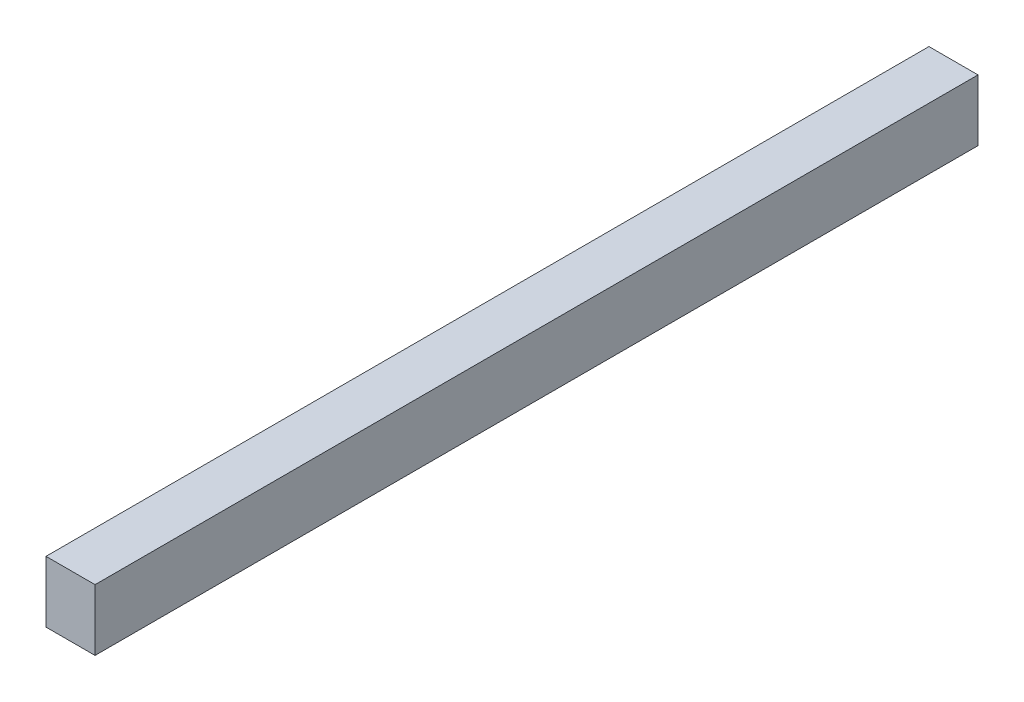
ISO-10303-21;
HEADER;
FILE_DESCRIPTION(('STEP AP214'),'2;1');
FILE_NAME('part.step','',(''),(''),'','','');
FILE_SCHEMA(('AUTOMOTIVE_DESIGN { 1 0 10303 214 1 1 1 1 }'));
ENDSEC;
DATA;
#1=APPLICATION_CONTEXT('core data for automotive mechanical design processes');
#2=APPLICATION_PROTOCOL_DEFINITION('international standard','automotive_design',2000,#1);
#3=PRODUCT_CONTEXT('',#1,'mechanical');
#4=PRODUCT('Part','Part','',(#3));
#5=PRODUCT_RELATED_PRODUCT_CATEGORY('part','',(#4));
#6=PRODUCT_DEFINITION_FORMATION('','',#4);
#7=PRODUCT_DEFINITION_CONTEXT('part definition',#1,'design');
#8=PRODUCT_DEFINITION('design','',#6,#7);
#9=PRODUCT_DEFINITION_SHAPE('','',#8);
#10=(LENGTH_UNIT() NAMED_UNIT(*) SI_UNIT(.MILLI.,.METRE.));
#11=(NAMED_UNIT(*) PLANE_ANGLE_UNIT() SI_UNIT($,.RADIAN.));
#12=(NAMED_UNIT(*) SI_UNIT($,.STERADIAN.) SOLID_ANGLE_UNIT());
#13=UNCERTAINTY_MEASURE_WITH_UNIT(LENGTH_MEASURE(1.E-05),#10,'distance_accuracy_value','');
#14=(GEOMETRIC_REPRESENTATION_CONTEXT(3) GLOBAL_UNCERTAINTY_ASSIGNED_CONTEXT((#13)) GLOBAL_UNIT_ASSIGNED_CONTEXT((#10,
#11,#12)) REPRESENTATION_CONTEXT('',''));
#15=CARTESIAN_POINT('',(0.,0.,0.));
#16=DIRECTION('',(0.,0.,1.));
#17=DIRECTION('',(1.,0.,0.));
#18=AXIS2_PLACEMENT_3D('',#15,#16,#17);
#19=CARTESIAN_POINT('',(12.7,-15.875,457.2));
#20=DIRECTION('',(-1.,0.,0.));
#21=DIRECTION('',(0.,0.,1.));
#22=AXIS2_PLACEMENT_3D('',#19,#20,#21);
#23=PLANE('',#22);
#24=DIRECTION('',(0.,1.,0.));
#25=VECTOR('',#24,1.);
#26=CARTESIAN_POINT('',(12.7,-15.875,0.));
#27=LINE('',#26,#25);
#28=CARTESIAN_POINT('',(12.7,-15.875,0.));
#29=VERTEX_POINT('',#28);
#30=CARTESIAN_POINT('',(12.7,15.875,0.));
#31=VERTEX_POINT('',#30);
#32=EDGE_CURVE('E96',#29,#31,#27,.T.);
#33=ORIENTED_EDGE('',*,*,#32,.T.);
#34=DIRECTION('',(0.,0.,-1.));
#35=VECTOR('',#34,1.);
#36=CARTESIAN_POINT('',(12.7,15.875,457.2));
#37=LINE('',#36,#35);
#38=CARTESIAN_POINT('',(12.7,15.875,457.2));
#39=VERTEX_POINT('',#38);
#40=EDGE_CURVE('E11',#39,#31,#37,.T.);
#41=ORIENTED_EDGE('',*,*,#40,.F.);
#42=DIRECTION('',(0.,1.,0.));
#43=VECTOR('',#42,1.);
#44=CARTESIAN_POINT('',(12.7,-15.875,457.2));
#45=LINE('',#44,#43);
#46=CARTESIAN_POINT('',(12.7,-15.875,457.2));
#47=VERTEX_POINT('',#46);
#48=EDGE_CURVE('E84',#47,#39,#45,.T.);
#49=ORIENTED_EDGE('',*,*,#48,.F.);
#50=DIRECTION('',(0.,0.,-1.));
#51=VECTOR('',#50,1.);
#52=CARTESIAN_POINT('',(12.7,-15.875,457.2));
#53=LINE('',#52,#51);
#54=EDGE_CURVE('E92',#47,#29,#53,.T.);
#55=ORIENTED_EDGE('',*,*,#54,.T.);
#56=EDGE_LOOP('',(#33,#41,#49,#55));
#57=FACE_BOUND('',#56,.T.);
#58=ADVANCED_FACE('F33',(#57),#23,.F.);
#59=CARTESIAN_POINT('',(-12.7,15.875,457.2));
#60=DIRECTION('',(0.,-1.,0.));
#61=DIRECTION('',(0.,0.,-1.));
#62=AXIS2_PLACEMENT_3D('',#59,#60,#61);
#63=PLANE('',#62);
#64=DIRECTION('',(-1.,0.,0.));
#65=VECTOR('',#64,1.);
#66=CARTESIAN_POINT('',(-12.7,15.875,0.));
#67=LINE('',#66,#65);
#68=CARTESIAN_POINT('',(-12.7,15.875,0.));
#69=VERTEX_POINT('',#68);
#70=EDGE_CURVE('E88',#31,#69,#67,.T.);
#71=ORIENTED_EDGE('',*,*,#70,.T.);
#72=DIRECTION('',(0.,0.,-1.));
#73=VECTOR('',#72,1.);
#74=CARTESIAN_POINT('',(-12.7,15.875,457.2));
#75=LINE('',#74,#73);
#76=CARTESIAN_POINT('',(-12.7,15.875,457.2));
#77=VERTEX_POINT('',#76);
#78=EDGE_CURVE('E41',#77,#69,#75,.T.);
#79=ORIENTED_EDGE('',*,*,#78,.F.);
#80=DIRECTION('',(-1.,0.,0.));
#81=VECTOR('',#80,1.);
#82=CARTESIAN_POINT('',(-12.7,15.875,457.2));
#83=LINE('',#82,#81);
#84=EDGE_CURVE('E79',#39,#77,#83,.T.);
#85=ORIENTED_EDGE('',*,*,#84,.F.);
#86=ORIENTED_EDGE('',*,*,#40,.T.);
#87=EDGE_LOOP('',(#71,#79,#85,#86));
#88=FACE_BOUND('',#87,.T.);
#89=ADVANCED_FACE('F87',(#88),#63,.F.);
#90=CARTESIAN_POINT('',(-12.7,-15.875,457.2));
#91=DIRECTION('',(1.,0.,0.));
#92=DIRECTION('',(0.,0.,-1.));
#93=AXIS2_PLACEMENT_3D('',#90,#91,#92);
#94=PLANE('',#93);
#95=DIRECTION('',(0.,-1.,0.));
#96=VECTOR('',#95,1.);
#97=CARTESIAN_POINT('',(-12.7,-15.875,0.));
#98=LINE('',#97,#96);
#99=CARTESIAN_POINT('',(-12.7,-15.875,0.));
#100=VERTEX_POINT('',#99);
#101=EDGE_CURVE('E66',#69,#100,#98,.T.);
#102=ORIENTED_EDGE('',*,*,#101,.T.);
#103=DIRECTION('',(0.,0.,-1.));
#104=VECTOR('',#103,1.);
#105=CARTESIAN_POINT('',(-12.7,-15.875,457.2));
#106=LINE('',#105,#104);
#107=CARTESIAN_POINT('',(-12.7,-15.875,457.2));
#108=VERTEX_POINT('',#107);
#109=EDGE_CURVE('E89',#108,#100,#106,.T.);
#110=ORIENTED_EDGE('',*,*,#109,.F.);
#111=DIRECTION('',(0.,-1.,0.));
#112=VECTOR('',#111,1.);
#113=CARTESIAN_POINT('',(-12.7,-15.875,457.2));
#114=LINE('',#113,#112);
#115=EDGE_CURVE('E82',#77,#108,#114,.T.);
#116=ORIENTED_EDGE('',*,*,#115,.F.);
#117=ORIENTED_EDGE('',*,*,#78,.T.);
#118=EDGE_LOOP('',(#102,#110,#116,#117));
#119=FACE_BOUND('',#118,.T.);
#120=ADVANCED_FACE('F90',(#119),#94,.F.);
#121=CARTESIAN_POINT('',(-12.7,-15.875,457.2));
#122=DIRECTION('',(0.,1.,0.));
#123=DIRECTION('',(0.,0.,1.));
#124=AXIS2_PLACEMENT_3D('',#121,#122,#123);
#125=PLANE('',#124);
#126=DIRECTION('',(1.,0.,0.));
#127=VECTOR('',#126,1.);
#128=CARTESIAN_POINT('',(-12.7,-15.875,0.));
#129=LINE('',#128,#127);
#130=EDGE_CURVE('E72',#100,#29,#129,.T.);
#131=ORIENTED_EDGE('',*,*,#130,.T.);
#132=ORIENTED_EDGE('',*,*,#54,.F.);
#133=DIRECTION('',(1.,0.,0.));
#134=VECTOR('',#133,1.);
#135=CARTESIAN_POINT('',(-12.7,-15.875,457.2));
#136=LINE('',#135,#134);
#137=EDGE_CURVE('E49',#108,#47,#136,.T.);
#138=ORIENTED_EDGE('',*,*,#137,.F.);
#139=ORIENTED_EDGE('',*,*,#109,.T.);
#140=EDGE_LOOP('',(#131,#132,#138,#139));
#141=FACE_BOUND('',#140,.T.);
#142=ADVANCED_FACE('F103',(#141),#125,.F.);
#143=CARTESIAN_POINT('',(0.,0.,457.2));
#144=DIRECTION('',(0.,0.,-1.));
#145=DIRECTION('',(-1.,0.,0.));
#146=AXIS2_PLACEMENT_3D('',#143,#144,#145);
#147=PLANE('',#146);
#148=ORIENTED_EDGE('',*,*,#48,.T.);
#149=ORIENTED_EDGE('',*,*,#84,.T.);
#150=ORIENTED_EDGE('',*,*,#115,.T.);
#151=ORIENTED_EDGE('',*,*,#137,.T.);
#152=EDGE_LOOP('',(#148,#149,#150,#151));
#153=FACE_BOUND('',#152,.T.);
#154=ADVANCED_FACE('F80',(#153),#147,.F.);
#155=CARTESIAN_POINT('',(0.,0.,0.));
#156=DIRECTION('',(0.,0.,-1.));
#157=DIRECTION('',(-1.,0.,0.));
#158=AXIS2_PLACEMENT_3D('',#155,#156,#157);
#159=PLANE('',#158);
#160=ORIENTED_EDGE('',*,*,#32,.F.);
#161=ORIENTED_EDGE('',*,*,#130,.F.);
#162=ORIENTED_EDGE('',*,*,#101,.F.);
#163=ORIENTED_EDGE('',*,*,#70,.F.);
#164=EDGE_LOOP('',(#160,#161,#162,#163));
#165=FACE_BOUND('',#164,.T.);
#166=ADVANCED_FACE('F106',(#165),#159,.T.);
#167=CLOSED_SHELL('',(#58,#89,#120,#142,#154,#166));
#168=MANIFOLD_SOLID_BREP('B2',#167);
#169=ADVANCED_BREP_SHAPE_REPRESENTATION('',(#18,#168),#14);
#170=SHAPE_DEFINITION_REPRESENTATION(#9,#169);
ENDSEC;
END-ISO-10303-21;
